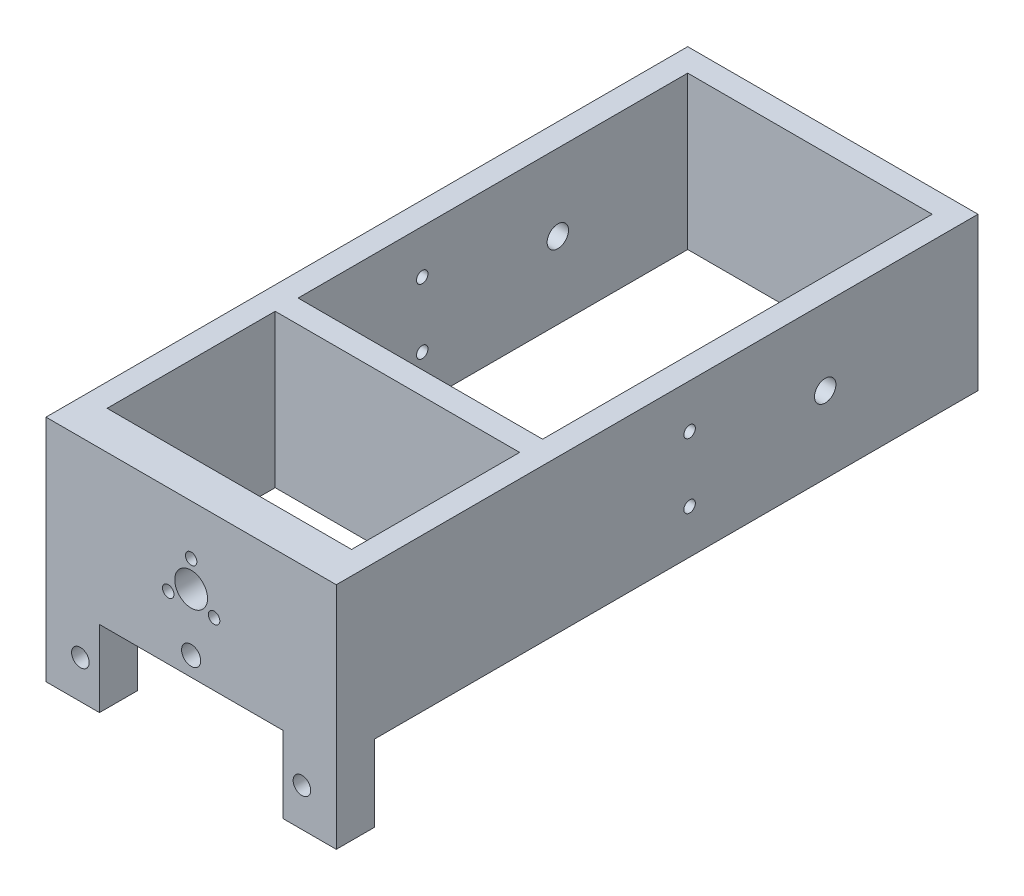
ISO-10303-21;
HEADER;
FILE_DESCRIPTION(('STEP AP214'),'2;1');
FILE_NAME('part.step','',(''),(''),'','','');
FILE_SCHEMA(('AUTOMOTIVE_DESIGN { 1 0 10303 214 1 1 1 1 }'));
ENDSEC;
DATA;
#1=APPLICATION_CONTEXT('core data for automotive mechanical design processes');
#2=APPLICATION_PROTOCOL_DEFINITION('international standard','automotive_design',2000,#1);
#3=PRODUCT_CONTEXT('',#1,'mechanical');
#4=PRODUCT('Part','Part','',(#3));
#5=PRODUCT_RELATED_PRODUCT_CATEGORY('part','',(#4));
#6=PRODUCT_DEFINITION_FORMATION('','',#4);
#7=PRODUCT_DEFINITION_CONTEXT('part definition',#1,'design');
#8=PRODUCT_DEFINITION('design','',#6,#7);
#9=PRODUCT_DEFINITION_SHAPE('','',#8);
#10=(LENGTH_UNIT() NAMED_UNIT(*) SI_UNIT(.MILLI.,.METRE.));
#11=(NAMED_UNIT(*) PLANE_ANGLE_UNIT() SI_UNIT($,.RADIAN.));
#12=(NAMED_UNIT(*) SI_UNIT($,.STERADIAN.) SOLID_ANGLE_UNIT());
#13=UNCERTAINTY_MEASURE_WITH_UNIT(LENGTH_MEASURE(1.E-05),#10,'distance_accuracy_value','');
#14=(GEOMETRIC_REPRESENTATION_CONTEXT(3) GLOBAL_UNCERTAINTY_ASSIGNED_CONTEXT((#13)) GLOBAL_UNIT_ASSIGNED_CONTEXT((#10,
#11,#12)) REPRESENTATION_CONTEXT('',''));
#15=CARTESIAN_POINT('',(0.,0.,0.));
#16=DIRECTION('',(0.,0.,1.));
#17=DIRECTION('',(1.,0.,0.));
#18=AXIS2_PLACEMENT_3D('',#15,#16,#17);
#19=CARTESIAN_POINT('',(19.,-10.,44.));
#20=DIRECTION('',(0.,1.,0.));
#21=DIRECTION('',(0.,0.,1.));
#22=AXIS2_PLACEMENT_3D('',#19,#20,#21);
#23=PLANE('',#22);
#24=DIRECTION('',(0.,0.,-1.));
#25=VECTOR('',#24,1.);
#26=CARTESIAN_POINT('',(12.,-10.,44.));
#27=LINE('',#26,#25);
#28=CARTESIAN_POINT('',(12.,-10.,44.));
#29=VERTEX_POINT('',#28);
#30=CARTESIAN_POINT('',(12.,-10.,39.));
#31=VERTEX_POINT('',#30);
#32=EDGE_CURVE('E76',#29,#31,#27,.T.);
#33=ORIENTED_EDGE('',*,*,#32,.F.);
#34=DIRECTION('',(-1.,0.,0.));
#35=VECTOR('',#34,1.);
#36=CARTESIAN_POINT('',(19.,-10.,44.));
#37=LINE('',#36,#35);
#38=CARTESIAN_POINT('',(-12.,-10.,44.));
#39=VERTEX_POINT('',#38);
#40=EDGE_CURVE('E11',#29,#39,#37,.T.);
#41=ORIENTED_EDGE('',*,*,#40,.T.);
#42=DIRECTION('',(0.,0.,1.));
#43=VECTOR('',#42,1.);
#44=CARTESIAN_POINT('',(-12.,-10.,44.));
#45=LINE('',#44,#43);
#46=CARTESIAN_POINT('',(-12.,-10.,39.));
#47=VERTEX_POINT('',#46);
#48=EDGE_CURVE('E240',#47,#39,#45,.T.);
#49=ORIENTED_EDGE('',*,*,#48,.F.);
#50=DIRECTION('',(1.,0.,0.));
#51=VECTOR('',#50,1.);
#52=CARTESIAN_POINT('',(16.,-10.,39.));
#53=LINE('',#52,#51);
#54=EDGE_CURVE('E328',#47,#31,#53,.T.);
#55=ORIENTED_EDGE('',*,*,#54,.T.);
#56=EDGE_LOOP('',(#33,#41,#49,#55));
#57=FACE_BOUND('',#56,.T.);
#58=ADVANCED_FACE('F51',(#57),#23,.F.);
#59=DIRECTION('',(-1.,0.,0.));
#60=VECTOR('',#59,1.);
#61=CARTESIAN_POINT('',(-16.,-10.,-37.));
#62=LINE('',#61,#60);
#63=CARTESIAN_POINT('',(16.,-10.,-37.));
#64=VERTEX_POINT('',#63);
#65=CARTESIAN_POINT('',(-16.,-10.,-37.));
#66=VERTEX_POINT('',#65);
#67=EDGE_CURVE('E282',#64,#66,#62,.T.);
#68=ORIENTED_EDGE('',*,*,#67,.T.);
#69=DIRECTION('',(0.,0.,1.));
#70=VECTOR('',#69,1.);
#71=CARTESIAN_POINT('',(-16.,-10.,-37.));
#72=LINE('',#71,#70);
#73=CARTESIAN_POINT('',(-16.,-10.,14.));
#74=VERTEX_POINT('',#73);
#75=EDGE_CURVE('E269',#66,#74,#72,.T.);
#76=ORIENTED_EDGE('',*,*,#75,.T.);
#77=DIRECTION('',(1.,0.,0.));
#78=VECTOR('',#77,1.);
#79=CARTESIAN_POINT('',(-16.,-10.,14.));
#80=LINE('',#79,#78);
#81=CARTESIAN_POINT('',(16.,-10.,14.));
#82=VERTEX_POINT('',#81);
#83=EDGE_CURVE('E273',#74,#82,#80,.T.);
#84=ORIENTED_EDGE('',*,*,#83,.T.);
#85=DIRECTION('',(0.,0.,-1.));
#86=VECTOR('',#85,1.);
#87=CARTESIAN_POINT('',(16.,-10.,-37.));
#88=LINE('',#87,#86);
#89=EDGE_CURVE('E278',#82,#64,#88,.T.);
#90=ORIENTED_EDGE('',*,*,#89,.T.);
#91=EDGE_LOOP('',(#68,#76,#84,#90));
#92=FACE_BOUND('',#91,.T.);
#93=DIRECTION('',(1.,0.,0.));
#94=VECTOR('',#93,1.);
#95=CARTESIAN_POINT('',(19.,-10.,39.));
#96=LINE('',#95,#94);
#97=CARTESIAN_POINT('',(16.,-10.,39.));
#98=VERTEX_POINT('',#97);
#99=CARTESIAN_POINT('',(19.,-10.,39.));
#100=VERTEX_POINT('',#99);
#101=EDGE_CURVE('E208',#98,#100,#96,.T.);
#102=ORIENTED_EDGE('',*,*,#101,.F.);
#103=DIRECTION('',(0.,0.,-1.));
#104=VECTOR('',#103,1.);
#105=CARTESIAN_POINT('',(16.,-10.,17.));
#106=LINE('',#105,#104);
#107=CARTESIAN_POINT('',(16.,-10.,17.));
#108=VERTEX_POINT('',#107);
#109=EDGE_CURVE('E315',#98,#108,#106,.T.);
#110=ORIENTED_EDGE('',*,*,#109,.T.);
#111=DIRECTION('',(-1.,0.,0.));
#112=VECTOR('',#111,1.);
#113=CARTESIAN_POINT('',(16.,-10.,17.));
#114=LINE('',#113,#112);
#115=CARTESIAN_POINT('',(-16.,-10.,17.));
#116=VERTEX_POINT('',#115);
#117=EDGE_CURVE('E319',#108,#116,#114,.T.);
#118=ORIENTED_EDGE('',*,*,#117,.T.);
#119=DIRECTION('',(0.,0.,1.));
#120=VECTOR('',#119,1.);
#121=CARTESIAN_POINT('',(-16.,-10.,17.));
#122=LINE('',#121,#120);
#123=CARTESIAN_POINT('',(-16.,-10.,39.));
#124=VERTEX_POINT('',#123);
#125=EDGE_CURVE('E324',#116,#124,#122,.T.);
#126=ORIENTED_EDGE('',*,*,#125,.T.);
#127=DIRECTION('',(1.,0.,0.));
#128=VECTOR('',#127,1.);
#129=CARTESIAN_POINT('',(-19.,-10.,39.));
#130=LINE('',#129,#128);
#131=CARTESIAN_POINT('',(-19.,-10.,39.));
#132=VERTEX_POINT('',#131);
#133=EDGE_CURVE('E234',#132,#124,#130,.T.);
#134=ORIENTED_EDGE('',*,*,#133,.F.);
#135=DIRECTION('',(0.,0.,-1.));
#136=VECTOR('',#135,1.);
#137=CARTESIAN_POINT('',(-19.,-10.,44.));
#138=LINE('',#137,#136);
#139=CARTESIAN_POINT('',(-19.,-10.,-40.));
#140=VERTEX_POINT('',#139);
#141=EDGE_CURVE('E407',#132,#140,#138,.T.);
#142=ORIENTED_EDGE('',*,*,#141,.T.);
#143=DIRECTION('',(-1.,0.,0.));
#144=VECTOR('',#143,1.);
#145=CARTESIAN_POINT('',(19.,-10.,-40.));
#146=LINE('',#145,#144);
#147=CARTESIAN_POINT('',(19.,-10.,-40.));
#148=VERTEX_POINT('',#147);
#149=EDGE_CURVE('E61',#148,#140,#146,.T.);
#150=ORIENTED_EDGE('',*,*,#149,.F.);
#151=DIRECTION('',(0.,0.,-1.));
#152=VECTOR('',#151,1.);
#153=CARTESIAN_POINT('',(19.,-10.,44.));
#154=LINE('',#153,#152);
#155=EDGE_CURVE('E69',#100,#148,#154,.T.);
#156=ORIENTED_EDGE('',*,*,#155,.F.);
#157=EDGE_LOOP('',(#102,#110,#118,#126,#134,#142,#150,#156));
#158=FACE_BOUND('',#157,.T.);
#159=ADVANCED_FACE('F456',(#92,#158),#23,.F.);
#160=CARTESIAN_POINT('',(19.,4.25,-2.25000000000001));
#161=DIRECTION('',(-1.,0.,0.));
#162=DIRECTION('',(0.,0.,1.));
#163=AXIS2_PLACEMENT_3D('',#160,#161,#162);
#164=CYLINDRICAL_SURFACE('',#163,0.75);
#165=CARTESIAN_POINT('',(-16.,4.25,-2.25000000000001));
#166=DIRECTION('',(-1.,0.,0.));
#167=DIRECTION('',(0.,0.,1.));
#168=AXIS2_PLACEMENT_3D('',#165,#166,#167);
#169=CIRCLE('',#168,0.75);
#170=CARTESIAN_POINT('',(-16.,4.25,-1.50000000000001));
#171=VERTEX_POINT('',#170);
#172=EDGE_CURVE('E368',#171,#171,#169,.T.);
#173=ORIENTED_EDGE('',*,*,#172,.F.);
#174=EDGE_LOOP('',(#173));
#175=FACE_BOUND('',#174,.T.);
#176=CARTESIAN_POINT('',(-19.,4.25,-2.25000000000001));
#177=DIRECTION('',(1.,0.,0.));
#178=DIRECTION('',(0.,0.,-1.));
#179=AXIS2_PLACEMENT_3D('',#176,#177,#178);
#180=CIRCLE('',#179,0.75);
#181=CARTESIAN_POINT('',(-19.,4.25,-3.00000000000001));
#182=VERTEX_POINT('',#181);
#183=EDGE_CURVE('E385',#182,#182,#180,.T.);
#184=ORIENTED_EDGE('',*,*,#183,.F.);
#185=EDGE_LOOP('',(#184));
#186=FACE_BOUND('',#185,.T.);
#187=ADVANCED_FACE('F460',(#175,#186),#164,.F.);
#188=CARTESIAN_POINT('',(19.,-4.25,-2.25000000000001));
#189=DIRECTION('',(-1.,0.,0.));
#190=DIRECTION('',(0.,0.,1.));
#191=AXIS2_PLACEMENT_3D('',#188,#189,#190);
#192=CYLINDRICAL_SURFACE('',#191,0.750000000000002);
#193=CARTESIAN_POINT('',(-16.,-4.25,-2.25000000000001));
#194=DIRECTION('',(-1.,0.,0.));
#195=DIRECTION('',(0.,0.,1.));
#196=AXIS2_PLACEMENT_3D('',#193,#194,#195);
#197=CIRCLE('',#196,0.750000000000002);
#198=CARTESIAN_POINT('',(-16.,-4.25,-1.50000000000001));
#199=VERTEX_POINT('',#198);
#200=EDGE_CURVE('E364',#199,#199,#197,.T.);
#201=ORIENTED_EDGE('',*,*,#200,.F.);
#202=EDGE_LOOP('',(#201));
#203=FACE_BOUND('',#202,.T.);
#204=CARTESIAN_POINT('',(-19.,-4.25,-2.25000000000001));
#205=DIRECTION('',(1.,0.,0.));
#206=DIRECTION('',(0.,0.,1.));
#207=AXIS2_PLACEMENT_3D('',#204,#205,#206);
#208=CIRCLE('',#207,0.750000000000002);
#209=CARTESIAN_POINT('',(-19.,-4.25,-1.50000000000001));
#210=VERTEX_POINT('',#209);
#211=EDGE_CURVE('E377',#210,#210,#208,.T.);
#212=ORIENTED_EDGE('',*,*,#211,.F.);
#213=EDGE_LOOP('',(#212));
#214=FACE_BOUND('',#213,.T.);
#215=ADVANCED_FACE('F451',(#203,#214),#192,.F.);
#216=CARTESIAN_POINT('',(19.,0.,-20.));
#217=DIRECTION('',(-1.,0.,0.));
#218=DIRECTION('',(0.,0.,1.));
#219=AXIS2_PLACEMENT_3D('',#216,#217,#218);
#220=CYLINDRICAL_SURFACE('',#219,1.4);
#221=CARTESIAN_POINT('',(-16.,0.,-20.));
#222=DIRECTION('',(-1.,0.,0.));
#223=DIRECTION('',(0.,0.,1.));
#224=AXIS2_PLACEMENT_3D('',#221,#222,#223);
#225=CIRCLE('',#224,1.4);
#226=CARTESIAN_POINT('',(-16.,0.,-18.6));
#227=VERTEX_POINT('',#226);
#228=EDGE_CURVE('E55',#227,#227,#225,.T.);
#229=ORIENTED_EDGE('',*,*,#228,.F.);
#230=EDGE_LOOP('',(#229));
#231=FACE_BOUND('',#230,.T.);
#232=CARTESIAN_POINT('',(-19.,0.,-20.));
#233=DIRECTION('',(1.,0.,0.));
#234=DIRECTION('',(0.,0.,-1.));
#235=AXIS2_PLACEMENT_3D('',#232,#233,#234);
#236=CIRCLE('',#235,1.4);
#237=CARTESIAN_POINT('',(-19.,0.,-21.4));
#238=VERTEX_POINT('',#237);
#239=EDGE_CURVE('E372',#238,#238,#236,.T.);
#240=ORIENTED_EDGE('',*,*,#239,.F.);
#241=EDGE_LOOP('',(#240));
#242=FACE_BOUND('',#241,.T.);
#243=ADVANCED_FACE('F438',(#231,#242),#220,.F.);
#244=CARTESIAN_POINT('',(19.,0.,0.));
#245=DIRECTION('',(1.,0.,0.));
#246=DIRECTION('',(0.,0.,-1.));
#247=AXIS2_PLACEMENT_3D('',#244,#245,#246);
#248=PLANE('',#247);
#249=CARTESIAN_POINT('',(19.,-4.25,-2.25000000000001));
#250=DIRECTION('',(1.,0.,0.));
#251=DIRECTION('',(0.,0.,1.));
#252=AXIS2_PLACEMENT_3D('',#249,#250,#251);
#253=CIRCLE('',#252,0.750000000000002);
#254=CARTESIAN_POINT('',(19.,-4.25,-1.50000000000001));
#255=VERTEX_POINT('',#254);
#256=EDGE_CURVE('E381',#255,#255,#253,.T.);
#257=ORIENTED_EDGE('',*,*,#256,.F.);
#258=EDGE_LOOP('',(#257));
#259=FACE_BOUND('',#258,.T.);
#260=DIRECTION('',(0.,-1.,0.));
#261=VECTOR('',#260,1.);
#262=CARTESIAN_POINT('',(19.,10.,44.));
#263=LINE('',#262,#261);
#264=CARTESIAN_POINT('',(19.,10.,44.));
#265=VERTEX_POINT('',#264);
#266=CARTESIAN_POINT('',(19.,-20.,44.));
#267=VERTEX_POINT('',#266);
#268=EDGE_CURVE('E179',#265,#267,#263,.T.);
#269=ORIENTED_EDGE('',*,*,#268,.T.);
#270=DIRECTION('',(0.,0.,1.));
#271=VECTOR('',#270,1.);
#272=CARTESIAN_POINT('',(19.,-20.,44.));
#273=LINE('',#272,#271);
#274=CARTESIAN_POINT('',(19.,-20.,39.));
#275=VERTEX_POINT('',#274);
#276=EDGE_CURVE('E185',#275,#267,#273,.T.);
#277=ORIENTED_EDGE('',*,*,#276,.F.);
#278=DIRECTION('',(0.,1.,0.));
#279=VECTOR('',#278,1.);
#280=CARTESIAN_POINT('',(19.,-20.,39.));
#281=LINE('',#280,#279);
#282=EDGE_CURVE('E222',#275,#100,#281,.T.);
#283=ORIENTED_EDGE('',*,*,#282,.T.);
#284=ORIENTED_EDGE('',*,*,#155,.T.);
#285=DIRECTION('',(0.,1.,0.));
#286=VECTOR('',#285,1.);
#287=CARTESIAN_POINT('',(19.,10.,-40.));
#288=LINE('',#287,#286);
#289=CARTESIAN_POINT('',(19.,10.,-40.));
#290=VERTEX_POINT('',#289);
#291=EDGE_CURVE('E399',#148,#290,#288,.T.);
#292=ORIENTED_EDGE('',*,*,#291,.T.);
#293=DIRECTION('',(0.,0.,1.));
#294=VECTOR('',#293,1.);
#295=CARTESIAN_POINT('',(19.,10.,44.));
#296=LINE('',#295,#294);
#297=EDGE_CURVE('E187',#290,#265,#296,.T.);
#298=ORIENTED_EDGE('',*,*,#297,.T.);
#299=EDGE_LOOP('',(#269,#277,#283,#284,#292,#298));
#300=FACE_BOUND('',#299,.T.);
#301=CARTESIAN_POINT('',(19.,4.25,-2.25000000000001));
#302=DIRECTION('',(1.,0.,0.));
#303=DIRECTION('',(0.,0.,-1.));
#304=AXIS2_PLACEMENT_3D('',#301,#302,#303);
#305=CIRCLE('',#304,0.75);
#306=CARTESIAN_POINT('',(19.,4.25,-3.00000000000001));
#307=VERTEX_POINT('',#306);
#308=EDGE_CURVE('E389',#307,#307,#305,.T.);
#309=ORIENTED_EDGE('',*,*,#308,.F.);
#310=EDGE_LOOP('',(#309));
#311=FACE_BOUND('',#310,.T.);
#312=CARTESIAN_POINT('',(19.,0.,-20.));
#313=DIRECTION('',(1.,0.,0.));
#314=DIRECTION('',(0.,0.,-1.));
#315=AXIS2_PLACEMENT_3D('',#312,#313,#314);
#316=CIRCLE('',#315,1.4);
#317=CARTESIAN_POINT('',(19.,0.,-21.4));
#318=VERTEX_POINT('',#317);
#319=EDGE_CURVE('E373',#318,#318,#316,.T.);
#320=ORIENTED_EDGE('',*,*,#319,.F.);
#321=EDGE_LOOP('',(#320));
#322=FACE_BOUND('',#321,.T.);
#323=ADVANCED_FACE('F181',(#259,#300,#311,#322),#248,.T.);
#324=CARTESIAN_POINT('',(-19.,0.,0.));
#325=DIRECTION('',(1.,0.,0.));
#326=DIRECTION('',(0.,0.,-1.));
#327=AXIS2_PLACEMENT_3D('',#324,#325,#326);
#328=PLANE('',#327);
#329=DIRECTION('',(0.,-1.,0.));
#330=VECTOR('',#329,1.);
#331=CARTESIAN_POINT('',(-19.,10.,44.));
#332=LINE('',#331,#330);
#333=CARTESIAN_POINT('',(-19.,10.,44.));
#334=VERTEX_POINT('',#333);
#335=CARTESIAN_POINT('',(-19.,-20.,44.));
#336=VERTEX_POINT('',#335);
#337=EDGE_CURVE('E393',#334,#336,#332,.T.);
#338=ORIENTED_EDGE('',*,*,#337,.F.);
#339=DIRECTION('',(0.,0.,1.));
#340=VECTOR('',#339,1.);
#341=CARTESIAN_POINT('',(-19.,10.,44.));
#342=LINE('',#341,#340);
#343=CARTESIAN_POINT('',(-19.,10.,-40.));
#344=VERTEX_POINT('',#343);
#345=EDGE_CURVE('E192',#344,#334,#342,.T.);
#346=ORIENTED_EDGE('',*,*,#345,.F.);
#347=DIRECTION('',(0.,1.,0.));
#348=VECTOR('',#347,1.);
#349=CARTESIAN_POINT('',(-19.,10.,-40.));
#350=LINE('',#349,#348);
#351=EDGE_CURVE('E410',#140,#344,#350,.T.);
#352=ORIENTED_EDGE('',*,*,#351,.F.);
#353=ORIENTED_EDGE('',*,*,#141,.F.);
#354=DIRECTION('',(0.,1.,0.));
#355=VECTOR('',#354,1.);
#356=CARTESIAN_POINT('',(-19.,-20.,39.));
#357=LINE('',#356,#355);
#358=CARTESIAN_POINT('',(-19.,-20.,39.));
#359=VERTEX_POINT('',#358);
#360=EDGE_CURVE('E264',#359,#132,#357,.T.);
#361=ORIENTED_EDGE('',*,*,#360,.F.);
#362=DIRECTION('',(0.,0.,-1.));
#363=VECTOR('',#362,1.);
#364=CARTESIAN_POINT('',(-19.,-20.,44.));
#365=LINE('',#364,#363);
#366=EDGE_CURVE('E235',#336,#359,#365,.T.);
#367=ORIENTED_EDGE('',*,*,#366,.F.);
#368=EDGE_LOOP('',(#338,#346,#352,#353,#361,#367));
#369=FACE_BOUND('',#368,.T.);
#370=ORIENTED_EDGE('',*,*,#183,.T.);
#371=EDGE_LOOP('',(#370));
#372=FACE_BOUND('',#371,.T.);
#373=ORIENTED_EDGE('',*,*,#211,.T.);
#374=EDGE_LOOP('',(#373));
#375=FACE_BOUND('',#374,.T.);
#376=ORIENTED_EDGE('',*,*,#239,.T.);
#377=EDGE_LOOP('',(#376));
#378=FACE_BOUND('',#377,.T.);
#379=ADVANCED_FACE('F442',(#369,#372,#375,#378),#328,.F.);
#380=CARTESIAN_POINT('',(19.,10.,44.));
#381=DIRECTION('',(0.,0.,-1.));
#382=DIRECTION('',(-1.,0.,0.));
#383=AXIS2_PLACEMENT_3D('',#380,#381,#382);
#384=PLANE('',#383);
#385=CARTESIAN_POINT('',(0.,3.46410161513776,44.));
#386=DIRECTION('',(0.,0.,1.));
#387=DIRECTION('',(1.,0.,0.));
#388=AXIS2_PLACEMENT_3D('',#385,#386,#387);
#389=CIRCLE('',#388,0.75);
#390=CARTESIAN_POINT('',(0.75,3.46410161513776,44.));
#391=VERTEX_POINT('',#390);
#392=EDGE_CURVE('E224',#391,#391,#389,.T.);
#393=ORIENTED_EDGE('',*,*,#392,.F.);
#394=EDGE_LOOP('',(#393));
#395=FACE_BOUND('',#394,.T.);
#396=CARTESIAN_POINT('',(0.,-7.5,44.));
#397=DIRECTION('',(0.,0.,1.));
#398=DIRECTION('',(1.,0.,0.));
#399=AXIS2_PLACEMENT_3D('',#396,#397,#398);
#400=CIRCLE('',#399,1.25);
#401=CARTESIAN_POINT('',(1.25,-7.5,44.));
#402=VERTEX_POINT('',#401);
#403=EDGE_CURVE('E642',#402,#402,#400,.T.);
#404=ORIENTED_EDGE('',*,*,#403,.F.);
#405=EDGE_LOOP('',(#404));
#406=FACE_BOUND('',#405,.T.);
#407=CARTESIAN_POINT('',(0.,0.,44.));
#408=DIRECTION('',(0.,0.,1.));
#409=DIRECTION('',(1.,0.,0.));
#410=AXIS2_PLACEMENT_3D('',#407,#408,#409);
#411=CIRCLE('',#410,2.15);
#412=CARTESIAN_POINT('',(2.15,0.,44.));
#413=VERTEX_POINT('',#412);
#414=EDGE_CURVE('E641',#413,#413,#411,.T.);
#415=ORIENTED_EDGE('',*,*,#414,.F.);
#416=EDGE_LOOP('',(#415));
#417=FACE_BOUND('',#416,.T.);
#418=CARTESIAN_POINT('',(-3.,-1.73205080756888,44.));
#419=DIRECTION('',(0.,0.,1.));
#420=DIRECTION('',(1.,0.,0.));
#421=AXIS2_PLACEMENT_3D('',#418,#419,#420);
#422=CIRCLE('',#421,0.75);
#423=CARTESIAN_POINT('',(-2.25,-1.73205080756888,44.));
#424=VERTEX_POINT('',#423);
#425=EDGE_CURVE('E657',#424,#424,#422,.T.);
#426=ORIENTED_EDGE('',*,*,#425,.F.);
#427=EDGE_LOOP('',(#426));
#428=FACE_BOUND('',#427,.T.);
#429=CARTESIAN_POINT('',(3.,-1.73205080756888,44.));
#430=DIRECTION('',(0.,0.,1.));
#431=DIRECTION('',(1.,0.,0.));
#432=AXIS2_PLACEMENT_3D('',#429,#430,#431);
#433=CIRCLE('',#432,0.75);
#434=CARTESIAN_POINT('',(3.75,-1.73205080756888,44.));
#435=VERTEX_POINT('',#434);
#436=EDGE_CURVE('E626',#435,#435,#433,.T.);
#437=ORIENTED_EDGE('',*,*,#436,.F.);
#438=EDGE_LOOP('',(#437));
#439=FACE_BOUND('',#438,.T.);
#440=CARTESIAN_POINT('',(-14.5,-15.,44.));
#441=DIRECTION('',(0.,0.,1.));
#442=DIRECTION('',(1.,0.,0.));
#443=AXIS2_PLACEMENT_3D('',#440,#441,#442);
#444=CIRCLE('',#443,1.15);
#445=CARTESIAN_POINT('',(-13.35,-15.,44.));
#446=VERTEX_POINT('',#445);
#447=EDGE_CURVE('E665',#446,#446,#444,.T.);
#448=ORIENTED_EDGE('',*,*,#447,.F.);
#449=EDGE_LOOP('',(#448));
#450=FACE_BOUND('',#449,.T.);
#451=CARTESIAN_POINT('',(14.5,-15.,44.));
#452=DIRECTION('',(0.,0.,1.));
#453=DIRECTION('',(-1.,0.,0.));
#454=AXIS2_PLACEMENT_3D('',#451,#452,#453);
#455=CIRCLE('',#454,1.15);
#456=CARTESIAN_POINT('',(13.35,-15.,44.));
#457=VERTEX_POINT('',#456);
#458=EDGE_CURVE('E671',#457,#457,#455,.T.);
#459=ORIENTED_EDGE('',*,*,#458,.F.);
#460=EDGE_LOOP('',(#459));
#461=FACE_BOUND('',#460,.T.);
#462=ORIENTED_EDGE('',*,*,#337,.T.);
#463=DIRECTION('',(-1.,0.,0.));
#464=VECTOR('',#463,1.);
#465=CARTESIAN_POINT('',(-19.,-20.,44.));
#466=LINE('',#465,#464);
#467=CARTESIAN_POINT('',(-12.,-20.,44.));
#468=VERTEX_POINT('',#467);
#469=EDGE_CURVE('E246',#468,#336,#466,.T.);
#470=ORIENTED_EDGE('',*,*,#469,.F.);
#471=DIRECTION('',(0.,1.,0.));
#472=VECTOR('',#471,1.);
#473=CARTESIAN_POINT('',(-12.,-20.,44.));
#474=LINE('',#473,#472);
#475=EDGE_CURVE('E250',#468,#39,#474,.T.);
#476=ORIENTED_EDGE('',*,*,#475,.T.);
#477=ORIENTED_EDGE('',*,*,#40,.F.);
#478=DIRECTION('',(0.,1.,0.));
#479=VECTOR('',#478,1.);
#480=CARTESIAN_POINT('',(12.,-20.,44.));
#481=LINE('',#480,#479);
#482=CARTESIAN_POINT('',(12.,-20.,44.));
#483=VERTEX_POINT('',#482);
#484=EDGE_CURVE('E197',#483,#29,#481,.T.);
#485=ORIENTED_EDGE('',*,*,#484,.F.);
#486=DIRECTION('',(-1.,0.,0.));
#487=VECTOR('',#486,1.);
#488=CARTESIAN_POINT('',(19.,-20.,44.));
#489=LINE('',#488,#487);
#490=EDGE_CURVE('E195',#267,#483,#489,.T.);
#491=ORIENTED_EDGE('',*,*,#490,.F.);
#492=ORIENTED_EDGE('',*,*,#268,.F.);
#493=DIRECTION('',(-1.,0.,0.));
#494=VECTOR('',#493,1.);
#495=CARTESIAN_POINT('',(19.,10.,44.));
#496=LINE('',#495,#494);
#497=EDGE_CURVE('E404',#265,#334,#496,.T.);
#498=ORIENTED_EDGE('',*,*,#497,.T.);
#499=EDGE_LOOP('',(#462,#470,#476,#477,#485,#491,#492,#498));
#500=FACE_BOUND('',#499,.T.);
#501=ADVANCED_FACE('F53',(#395,#406,#417,#428,#439,#450,#461,#500),#384,.F.);
#502=CARTESIAN_POINT('',(19.,10.,-40.));
#503=DIRECTION('',(0.,0.,1.));
#504=DIRECTION('',(1.,0.,0.));
#505=AXIS2_PLACEMENT_3D('',#502,#503,#504);
#506=PLANE('',#505);
#507=ORIENTED_EDGE('',*,*,#351,.T.);
#508=DIRECTION('',(-1.,0.,0.));
#509=VECTOR('',#508,1.);
#510=CARTESIAN_POINT('',(19.,10.,-40.));
#511=LINE('',#510,#509);
#512=EDGE_CURVE('E417',#290,#344,#511,.T.);
#513=ORIENTED_EDGE('',*,*,#512,.F.);
#514=ORIENTED_EDGE('',*,*,#291,.F.);
#515=ORIENTED_EDGE('',*,*,#149,.T.);
#516=EDGE_LOOP('',(#507,#513,#514,#515));
#517=FACE_BOUND('',#516,.T.);
#518=ADVANCED_FACE('F463',(#517),#506,.F.);
#519=CARTESIAN_POINT('',(19.,10.,44.));
#520=DIRECTION('',(0.,-1.,0.));
#521=DIRECTION('',(0.,0.,-1.));
#522=AXIS2_PLACEMENT_3D('',#519,#520,#521);
#523=PLANE('',#522);
#524=DIRECTION('',(1.,0.,0.));
#525=VECTOR('',#524,1.);
#526=CARTESIAN_POINT('',(-16.,10.,14.));
#527=LINE('',#526,#525);
#528=CARTESIAN_POINT('',(-16.,10.,14.));
#529=VERTEX_POINT('',#528);
#530=CARTESIAN_POINT('',(16.,10.,14.));
#531=VERTEX_POINT('',#530);
#532=EDGE_CURVE('E290',#529,#531,#527,.T.);
#533=ORIENTED_EDGE('',*,*,#532,.F.);
#534=DIRECTION('',(0.,0.,1.));
#535=VECTOR('',#534,1.);
#536=CARTESIAN_POINT('',(-16.,10.,-37.));
#537=LINE('',#536,#535);
#538=CARTESIAN_POINT('',(-16.,10.,-37.));
#539=VERTEX_POINT('',#538);
#540=EDGE_CURVE('E287',#539,#529,#537,.T.);
#541=ORIENTED_EDGE('',*,*,#540,.F.);
#542=DIRECTION('',(-1.,0.,0.));
#543=VECTOR('',#542,1.);
#544=CARTESIAN_POINT('',(-16.,10.,-37.));
#545=LINE('',#544,#543);
#546=CARTESIAN_POINT('',(16.,10.,-37.));
#547=VERTEX_POINT('',#546);
#548=EDGE_CURVE('E274',#547,#539,#545,.T.);
#549=ORIENTED_EDGE('',*,*,#548,.F.);
#550=DIRECTION('',(0.,0.,-1.));
#551=VECTOR('',#550,1.);
#552=CARTESIAN_POINT('',(16.,10.,-37.));
#553=LINE('',#552,#551);
#554=EDGE_CURVE('E295',#531,#547,#553,.T.);
#555=ORIENTED_EDGE('',*,*,#554,.F.);
#556=EDGE_LOOP('',(#533,#541,#549,#555));
#557=FACE_BOUND('',#556,.T.);
#558=DIRECTION('',(-1.,0.,0.));
#559=VECTOR('',#558,1.);
#560=CARTESIAN_POINT('',(16.,10.,17.));
#561=LINE('',#560,#559);
#562=CARTESIAN_POINT('',(16.,10.,17.));
#563=VERTEX_POINT('',#562);
#564=CARTESIAN_POINT('',(-16.,10.,17.));
#565=VERTEX_POINT('',#564);
#566=EDGE_CURVE('E334',#563,#565,#561,.T.);
#567=ORIENTED_EDGE('',*,*,#566,.F.);
#568=DIRECTION('',(0.,0.,-1.));
#569=VECTOR('',#568,1.);
#570=CARTESIAN_POINT('',(16.,10.,17.));
#571=LINE('',#570,#569);
#572=CARTESIAN_POINT('',(16.,10.,39.));
#573=VERTEX_POINT('',#572);
#574=EDGE_CURVE('E268',#573,#563,#571,.T.);
#575=ORIENTED_EDGE('',*,*,#574,.F.);
#576=DIRECTION('',(1.,0.,0.));
#577=VECTOR('',#576,1.);
#578=CARTESIAN_POINT('',(16.,10.,39.));
#579=LINE('',#578,#577);
#580=CARTESIAN_POINT('',(-16.,10.,39.));
#581=VERTEX_POINT('',#580);
#582=EDGE_CURVE('E320',#581,#573,#579,.T.);
#583=ORIENTED_EDGE('',*,*,#582,.F.);
#584=DIRECTION('',(0.,0.,1.));
#585=VECTOR('',#584,1.);
#586=CARTESIAN_POINT('',(-16.,10.,17.));
#587=LINE('',#586,#585);
#588=EDGE_CURVE('E338',#565,#581,#587,.T.);
#589=ORIENTED_EDGE('',*,*,#588,.F.);
#590=EDGE_LOOP('',(#567,#575,#583,#589));
#591=FACE_BOUND('',#590,.T.);
#592=ORIENTED_EDGE('',*,*,#345,.T.);
#593=ORIENTED_EDGE('',*,*,#497,.F.);
#594=ORIENTED_EDGE('',*,*,#297,.F.);
#595=ORIENTED_EDGE('',*,*,#512,.T.);
#596=EDGE_LOOP('',(#592,#593,#594,#595));
#597=FACE_BOUND('',#596,.T.);
#598=ADVANCED_FACE('F466',(#557,#591,#597),#523,.F.);
#599=CARTESIAN_POINT('',(16.,4.25,-2.25000000000001));
#600=DIRECTION('',(1.,0.,0.));
#601=DIRECTION('',(0.,0.,-1.));
#602=AXIS2_PLACEMENT_3D('',#599,#600,#601);
#603=CIRCLE('',#602,0.75);
#604=CARTESIAN_POINT('',(16.,4.25,-3.00000000000001));
#605=VERTEX_POINT('',#604);
#606=EDGE_CURVE('E360',#605,#605,#603,.T.);
#607=ORIENTED_EDGE('',*,*,#606,.F.);
#608=EDGE_LOOP('',(#607));
#609=FACE_BOUND('',#608,.T.);
#610=ORIENTED_EDGE('',*,*,#308,.T.);
#611=EDGE_LOOP('',(#610));
#612=FACE_BOUND('',#611,.T.);
#613=ADVANCED_FACE('F469',(#609,#612),#164,.F.);
#614=CARTESIAN_POINT('',(16.,-4.25,-2.25000000000001));
#615=DIRECTION('',(1.,0.,0.));
#616=DIRECTION('',(0.,0.,-1.));
#617=AXIS2_PLACEMENT_3D('',#614,#615,#616);
#618=CIRCLE('',#617,0.750000000000002);
#619=CARTESIAN_POINT('',(16.,-4.25,-3.00000000000001));
#620=VERTEX_POINT('',#619);
#621=EDGE_CURVE('E356',#620,#620,#618,.T.);
#622=ORIENTED_EDGE('',*,*,#621,.F.);
#623=EDGE_LOOP('',(#622));
#624=FACE_BOUND('',#623,.T.);
#625=ORIENTED_EDGE('',*,*,#256,.T.);
#626=EDGE_LOOP('',(#625));
#627=FACE_BOUND('',#626,.T.);
#628=ADVANCED_FACE('F436',(#624,#627),#192,.F.);
#629=CARTESIAN_POINT('',(16.,0.,-20.));
#630=DIRECTION('',(1.,0.,0.));
#631=DIRECTION('',(0.,0.,-1.));
#632=AXIS2_PLACEMENT_3D('',#629,#630,#631);
#633=CIRCLE('',#632,1.4);
#634=CARTESIAN_POINT('',(16.,0.,-21.4));
#635=VERTEX_POINT('',#634);
#636=EDGE_CURVE('E305',#635,#635,#633,.T.);
#637=ORIENTED_EDGE('',*,*,#636,.F.);
#638=EDGE_LOOP('',(#637));
#639=FACE_BOUND('',#638,.T.);
#640=ORIENTED_EDGE('',*,*,#319,.T.);
#641=EDGE_LOOP('',(#640));
#642=FACE_BOUND('',#641,.T.);
#643=ADVANCED_FACE('F432',(#639,#642),#220,.F.);
#644=CARTESIAN_POINT('',(-16.,-10.,-37.));
#645=DIRECTION('',(-1.,0.,0.));
#646=DIRECTION('',(0.,0.,1.));
#647=AXIS2_PLACEMENT_3D('',#644,#645,#646);
#648=PLANE('',#647);
#649=ORIENTED_EDGE('',*,*,#172,.T.);
#650=EDGE_LOOP('',(#649));
#651=FACE_BOUND('',#650,.T.);
#652=ORIENTED_EDGE('',*,*,#200,.T.);
#653=EDGE_LOOP('',(#652));
#654=FACE_BOUND('',#653,.T.);
#655=ORIENTED_EDGE('',*,*,#228,.T.);
#656=EDGE_LOOP('',(#655));
#657=FACE_BOUND('',#656,.T.);
#658=ORIENTED_EDGE('',*,*,#540,.T.);
#659=DIRECTION('',(0.,1.,0.));
#660=VECTOR('',#659,1.);
#661=CARTESIAN_POINT('',(-16.,-10.,14.));
#662=LINE('',#661,#660);
#663=EDGE_CURVE('E286',#74,#529,#662,.T.);
#664=ORIENTED_EDGE('',*,*,#663,.F.);
#665=ORIENTED_EDGE('',*,*,#75,.F.);
#666=DIRECTION('',(0.,1.,0.));
#667=VECTOR('',#666,1.);
#668=CARTESIAN_POINT('',(-16.,-10.,-37.));
#669=LINE('',#668,#667);
#670=EDGE_CURVE('E302',#66,#539,#669,.T.);
#671=ORIENTED_EDGE('',*,*,#670,.T.);
#672=EDGE_LOOP('',(#658,#664,#665,#671));
#673=FACE_BOUND('',#672,.T.);
#674=ADVANCED_FACE('F435',(#651,#654,#657,#673),#648,.F.);
#675=CARTESIAN_POINT('',(-16.,-10.,-37.));
#676=DIRECTION('',(0.,0.,-1.));
#677=DIRECTION('',(-1.,0.,0.));
#678=AXIS2_PLACEMENT_3D('',#675,#676,#677);
#679=PLANE('',#678);
#680=ORIENTED_EDGE('',*,*,#548,.T.);
#681=ORIENTED_EDGE('',*,*,#670,.F.);
#682=ORIENTED_EDGE('',*,*,#67,.F.);
#683=DIRECTION('',(0.,1.,0.));
#684=VECTOR('',#683,1.);
#685=CARTESIAN_POINT('',(16.,-10.,-37.));
#686=LINE('',#685,#684);
#687=EDGE_CURVE('E306',#64,#547,#686,.T.);
#688=ORIENTED_EDGE('',*,*,#687,.T.);
#689=EDGE_LOOP('',(#680,#681,#682,#688));
#690=FACE_BOUND('',#689,.T.);
#691=ADVANCED_FACE('F552',(#690),#679,.F.);
#692=CARTESIAN_POINT('',(16.,-10.,-37.));
#693=DIRECTION('',(1.,0.,0.));
#694=DIRECTION('',(0.,0.,-1.));
#695=AXIS2_PLACEMENT_3D('',#692,#693,#694);
#696=PLANE('',#695);
#697=ORIENTED_EDGE('',*,*,#606,.T.);
#698=EDGE_LOOP('',(#697));
#699=FACE_BOUND('',#698,.T.);
#700=ORIENTED_EDGE('',*,*,#621,.T.);
#701=EDGE_LOOP('',(#700));
#702=FACE_BOUND('',#701,.T.);
#703=ORIENTED_EDGE('',*,*,#636,.T.);
#704=EDGE_LOOP('',(#703));
#705=FACE_BOUND('',#704,.T.);
#706=ORIENTED_EDGE('',*,*,#554,.T.);
#707=ORIENTED_EDGE('',*,*,#687,.F.);
#708=ORIENTED_EDGE('',*,*,#89,.F.);
#709=DIRECTION('',(0.,1.,0.));
#710=VECTOR('',#709,1.);
#711=CARTESIAN_POINT('',(16.,-10.,14.));
#712=LINE('',#711,#710);
#713=EDGE_CURVE('E309',#82,#531,#712,.T.);
#714=ORIENTED_EDGE('',*,*,#713,.T.);
#715=EDGE_LOOP('',(#706,#707,#708,#714));
#716=FACE_BOUND('',#715,.T.);
#717=ADVANCED_FACE('F429',(#699,#702,#705,#716),#696,.F.);
#718=CARTESIAN_POINT('',(-16.,-10.,14.));
#719=DIRECTION('',(0.,0.,1.));
#720=DIRECTION('',(1.,0.,0.));
#721=AXIS2_PLACEMENT_3D('',#718,#719,#720);
#722=PLANE('',#721);
#723=ORIENTED_EDGE('',*,*,#532,.T.);
#724=ORIENTED_EDGE('',*,*,#713,.F.);
#725=ORIENTED_EDGE('',*,*,#83,.F.);
#726=ORIENTED_EDGE('',*,*,#663,.T.);
#727=EDGE_LOOP('',(#723,#724,#725,#726));
#728=FACE_BOUND('',#727,.T.);
#729=ADVANCED_FACE('F517',(#728),#722,.F.);
#730=CARTESIAN_POINT('',(16.,-10.,17.));
#731=DIRECTION('',(1.,0.,0.));
#732=DIRECTION('',(0.,0.,-1.));
#733=AXIS2_PLACEMENT_3D('',#730,#731,#732);
#734=PLANE('',#733);
#735=ORIENTED_EDGE('',*,*,#574,.T.);
#736=DIRECTION('',(0.,1.,0.));
#737=VECTOR('',#736,1.);
#738=CARTESIAN_POINT('',(16.,-10.,17.));
#739=LINE('',#738,#737);
#740=EDGE_CURVE('E331',#108,#563,#739,.T.);
#741=ORIENTED_EDGE('',*,*,#740,.F.);
#742=ORIENTED_EDGE('',*,*,#109,.F.);
#743=DIRECTION('',(0.,1.,0.));
#744=VECTOR('',#743,1.);
#745=CARTESIAN_POINT('',(16.,-10.,39.));
#746=LINE('',#745,#744);
#747=EDGE_CURVE('E291',#98,#573,#746,.T.);
#748=ORIENTED_EDGE('',*,*,#747,.T.);
#749=EDGE_LOOP('',(#735,#741,#742,#748));
#750=FACE_BOUND('',#749,.T.);
#751=ADVANCED_FACE('F515',(#750),#734,.F.);
#752=CARTESIAN_POINT('',(16.,-10.,39.));
#753=DIRECTION('',(0.,0.,1.));
#754=DIRECTION('',(1.,0.,0.));
#755=AXIS2_PLACEMENT_3D('',#752,#753,#754);
#756=PLANE('',#755);
#757=CARTESIAN_POINT('',(0.,3.46410161513776,39.));
#758=DIRECTION('',(0.,0.,1.));
#759=DIRECTION('',(1.,0.,0.));
#760=AXIS2_PLACEMENT_3D('',#757,#758,#759);
#761=CIRCLE('',#760,0.75);
#762=CARTESIAN_POINT('',(0.75,3.46410161513776,39.));
#763=VERTEX_POINT('',#762);
#764=EDGE_CURVE('E624',#763,#763,#761,.F.);
#765=ORIENTED_EDGE('',*,*,#764,.F.);
#766=EDGE_LOOP('',(#765));
#767=FACE_BOUND('',#766,.T.);
#768=CARTESIAN_POINT('',(0.,-7.5,39.));
#769=DIRECTION('',(0.,0.,1.));
#770=DIRECTION('',(1.,0.,0.));
#771=AXIS2_PLACEMENT_3D('',#768,#769,#770);
#772=CIRCLE('',#771,1.25);
#773=CARTESIAN_POINT('',(1.25,-7.5,39.));
#774=VERTEX_POINT('',#773);
#775=EDGE_CURVE('E647',#774,#774,#772,.F.);
#776=ORIENTED_EDGE('',*,*,#775,.F.);
#777=EDGE_LOOP('',(#776));
#778=FACE_BOUND('',#777,.T.);
#779=CARTESIAN_POINT('',(0.,0.,39.));
#780=DIRECTION('',(0.,0.,1.));
#781=DIRECTION('',(1.,0.,0.));
#782=AXIS2_PLACEMENT_3D('',#779,#780,#781);
#783=CIRCLE('',#782,2.15);
#784=CARTESIAN_POINT('',(2.15,0.,39.));
#785=VERTEX_POINT('',#784);
#786=EDGE_CURVE('E637',#785,#785,#783,.F.);
#787=ORIENTED_EDGE('',*,*,#786,.F.);
#788=EDGE_LOOP('',(#787));
#789=FACE_BOUND('',#788,.T.);
#790=CARTESIAN_POINT('',(-3.,-1.73205080756888,39.));
#791=DIRECTION('',(0.,0.,1.));
#792=DIRECTION('',(1.,0.,0.));
#793=AXIS2_PLACEMENT_3D('',#790,#791,#792);
#794=CIRCLE('',#793,0.75);
#795=CARTESIAN_POINT('',(-2.25,-1.73205080756888,39.));
#796=VERTEX_POINT('',#795);
#797=EDGE_CURVE('E646',#796,#796,#794,.F.);
#798=ORIENTED_EDGE('',*,*,#797,.F.);
#799=EDGE_LOOP('',(#798));
#800=FACE_BOUND('',#799,.T.);
#801=CARTESIAN_POINT('',(3.,-1.73205080756888,39.));
#802=DIRECTION('',(0.,0.,1.));
#803=DIRECTION('',(1.,0.,0.));
#804=AXIS2_PLACEMENT_3D('',#801,#802,#803);
#805=CIRCLE('',#804,0.75);
#806=CARTESIAN_POINT('',(3.75,-1.73205080756888,39.));
#807=VERTEX_POINT('',#806);
#808=EDGE_CURVE('E634',#807,#807,#805,.F.);
#809=ORIENTED_EDGE('',*,*,#808,.F.);
#810=EDGE_LOOP('',(#809));
#811=FACE_BOUND('',#810,.T.);
#812=CARTESIAN_POINT('',(-14.5,-15.,39.));
#813=DIRECTION('',(0.,0.,1.));
#814=DIRECTION('',(1.,0.,0.));
#815=AXIS2_PLACEMENT_3D('',#812,#813,#814);
#816=CIRCLE('',#815,1.15);
#817=CARTESIAN_POINT('',(-13.35,-15.,39.));
#818=VERTEX_POINT('',#817);
#819=EDGE_CURVE('E651',#818,#818,#816,.F.);
#820=ORIENTED_EDGE('',*,*,#819,.F.);
#821=EDGE_LOOP('',(#820));
#822=FACE_BOUND('',#821,.T.);
#823=CARTESIAN_POINT('',(14.5,-15.,39.));
#824=DIRECTION('',(0.,0.,1.));
#825=DIRECTION('',(1.,0.,0.));
#826=AXIS2_PLACEMENT_3D('',#823,#824,#825);
#827=CIRCLE('',#826,1.15);
#828=CARTESIAN_POINT('',(15.65,-15.,39.));
#829=VERTEX_POINT('',#828);
#830=EDGE_CURVE('E215',#829,#829,#827,.F.);
#831=ORIENTED_EDGE('',*,*,#830,.F.);
#832=EDGE_LOOP('',(#831));
#833=FACE_BOUND('',#832,.T.);
#834=ORIENTED_EDGE('',*,*,#582,.T.);
#835=ORIENTED_EDGE('',*,*,#747,.F.);
#836=ORIENTED_EDGE('',*,*,#101,.T.);
#837=ORIENTED_EDGE('',*,*,#282,.F.);
#838=DIRECTION('',(1.,0.,0.));
#839=VECTOR('',#838,1.);
#840=CARTESIAN_POINT('',(19.,-20.,39.));
#841=LINE('',#840,#839);
#842=CARTESIAN_POINT('',(12.,-20.,39.));
#843=VERTEX_POINT('',#842);
#844=EDGE_CURVE('E205',#843,#275,#841,.T.);
#845=ORIENTED_EDGE('',*,*,#844,.F.);
#846=DIRECTION('',(0.,1.,0.));
#847=VECTOR('',#846,1.);
#848=CARTESIAN_POINT('',(12.,-20.,39.));
#849=LINE('',#848,#847);
#850=EDGE_CURVE('E228',#843,#31,#849,.T.);
#851=ORIENTED_EDGE('',*,*,#850,.T.);
#852=ORIENTED_EDGE('',*,*,#54,.F.);
#853=DIRECTION('',(0.,1.,0.));
#854=VECTOR('',#853,1.);
#855=CARTESIAN_POINT('',(-12.,-20.,39.));
#856=LINE('',#855,#854);
#857=CARTESIAN_POINT('',(-12.,-20.,39.));
#858=VERTEX_POINT('',#857);
#859=EDGE_CURVE('E260',#858,#47,#856,.T.);
#860=ORIENTED_EDGE('',*,*,#859,.F.);
#861=DIRECTION('',(1.,0.,0.));
#862=VECTOR('',#861,1.);
#863=CARTESIAN_POINT('',(-19.,-20.,39.));
#864=LINE('',#863,#862);
#865=EDGE_CURVE('E239',#359,#858,#864,.T.);
#866=ORIENTED_EDGE('',*,*,#865,.F.);
#867=ORIENTED_EDGE('',*,*,#360,.T.);
#868=ORIENTED_EDGE('',*,*,#133,.T.);
#869=DIRECTION('',(0.,1.,0.));
#870=VECTOR('',#869,1.);
#871=CARTESIAN_POINT('',(-16.,-10.,39.));
#872=LINE('',#871,#870);
#873=EDGE_CURVE('E347',#124,#581,#872,.T.);
#874=ORIENTED_EDGE('',*,*,#873,.T.);
#875=EDGE_LOOP('',(#834,#835,#836,#837,#845,#851,#852,#860,#866,#867,#868,#874));
#876=FACE_BOUND('',#875,.T.);
#877=ADVANCED_FACE('F504',(#767,#778,#789,#800,#811,#822,#833,#876),#756,.F.);
#878=CARTESIAN_POINT('',(-16.,-10.,17.));
#879=DIRECTION('',(-1.,0.,0.));
#880=DIRECTION('',(0.,0.,1.));
#881=AXIS2_PLACEMENT_3D('',#878,#879,#880);
#882=PLANE('',#881);
#883=ORIENTED_EDGE('',*,*,#588,.T.);
#884=ORIENTED_EDGE('',*,*,#873,.F.);
#885=ORIENTED_EDGE('',*,*,#125,.F.);
#886=DIRECTION('',(0.,1.,0.));
#887=VECTOR('',#886,1.);
#888=CARTESIAN_POINT('',(-16.,-10.,17.));
#889=LINE('',#888,#887);
#890=EDGE_CURVE('E350',#116,#565,#889,.T.);
#891=ORIENTED_EDGE('',*,*,#890,.T.);
#892=EDGE_LOOP('',(#883,#884,#885,#891));
#893=FACE_BOUND('',#892,.T.);
#894=ADVANCED_FACE('F510',(#893),#882,.F.);
#895=CARTESIAN_POINT('',(16.,-10.,17.));
#896=DIRECTION('',(0.,0.,-1.));
#897=DIRECTION('',(-1.,0.,0.));
#898=AXIS2_PLACEMENT_3D('',#895,#896,#897);
#899=PLANE('',#898);
#900=ORIENTED_EDGE('',*,*,#566,.T.);
#901=ORIENTED_EDGE('',*,*,#890,.F.);
#902=ORIENTED_EDGE('',*,*,#117,.F.);
#903=ORIENTED_EDGE('',*,*,#740,.T.);
#904=EDGE_LOOP('',(#900,#901,#902,#903));
#905=FACE_BOUND('',#904,.T.);
#906=ADVANCED_FACE('F512',(#905),#899,.F.);
#907=CARTESIAN_POINT('',(-12.,-20.,44.));
#908=DIRECTION('',(-1.,0.,0.));
#909=DIRECTION('',(0.,0.,1.));
#910=AXIS2_PLACEMENT_3D('',#907,#908,#909);
#911=PLANE('',#910);
#912=ORIENTED_EDGE('',*,*,#48,.T.);
#913=ORIENTED_EDGE('',*,*,#475,.F.);
#914=DIRECTION('',(0.,0.,1.));
#915=VECTOR('',#914,1.);
#916=CARTESIAN_POINT('',(-12.,-20.,44.));
#917=LINE('',#916,#915);
#918=EDGE_CURVE('E243',#858,#468,#917,.T.);
#919=ORIENTED_EDGE('',*,*,#918,.F.);
#920=ORIENTED_EDGE('',*,*,#859,.T.);
#921=EDGE_LOOP('',(#912,#913,#919,#920));
#922=FACE_BOUND('',#921,.T.);
#923=ADVANCED_FACE('F498',(#922),#911,.F.);
#924=CARTESIAN_POINT('',(0.,-20.,0.));
#925=DIRECTION('',(0.,-1.,0.));
#926=DIRECTION('',(0.,0.,-1.));
#927=AXIS2_PLACEMENT_3D('',#924,#925,#926);
#928=PLANE('',#927);
#929=ORIENTED_EDGE('',*,*,#366,.T.);
#930=ORIENTED_EDGE('',*,*,#865,.T.);
#931=ORIENTED_EDGE('',*,*,#918,.T.);
#932=ORIENTED_EDGE('',*,*,#469,.T.);
#933=EDGE_LOOP('',(#929,#930,#931,#932));
#934=FACE_BOUND('',#933,.T.);
#935=ADVANCED_FACE('F493',(#934),#928,.T.);
#936=CARTESIAN_POINT('',(12.,-20.,44.));
#937=DIRECTION('',(1.,0.,0.));
#938=DIRECTION('',(0.,0.,-1.));
#939=AXIS2_PLACEMENT_3D('',#936,#937,#938);
#940=PLANE('',#939);
#941=ORIENTED_EDGE('',*,*,#32,.T.);
#942=ORIENTED_EDGE('',*,*,#850,.F.);
#943=DIRECTION('',(0.,0.,-1.));
#944=VECTOR('',#943,1.);
#945=CARTESIAN_POINT('',(12.,-20.,44.));
#946=LINE('',#945,#944);
#947=EDGE_CURVE('E201',#483,#843,#946,.T.);
#948=ORIENTED_EDGE('',*,*,#947,.F.);
#949=ORIENTED_EDGE('',*,*,#484,.T.);
#950=EDGE_LOOP('',(#941,#942,#948,#949));
#951=FACE_BOUND('',#950,.T.);
#952=ADVANCED_FACE('F503',(#951),#940,.F.);
#953=CARTESIAN_POINT('',(0.,-20.,0.));
#954=DIRECTION('',(0.,1.,0.));
#955=DIRECTION('',(0.,0.,1.));
#956=AXIS2_PLACEMENT_3D('',#953,#954,#955);
#957=PLANE('',#956);
#958=ORIENTED_EDGE('',*,*,#276,.T.);
#959=ORIENTED_EDGE('',*,*,#490,.T.);
#960=ORIENTED_EDGE('',*,*,#947,.T.);
#961=ORIENTED_EDGE('',*,*,#844,.T.);
#962=EDGE_LOOP('',(#958,#959,#960,#961));
#963=FACE_BOUND('',#962,.T.);
#964=ADVANCED_FACE('F203',(#963),#957,.F.);
#965=CARTESIAN_POINT('',(14.5,-15.,-40.001));
#966=DIRECTION('',(0.,0.,1.));
#967=DIRECTION('',(1.,0.,0.));
#968=AXIS2_PLACEMENT_3D('',#965,#966,#967);
#969=CYLINDRICAL_SURFACE('',#968,1.15);
#970=ORIENTED_EDGE('',*,*,#458,.T.);
#971=EDGE_LOOP('',(#970));
#972=FACE_BOUND('',#971,.T.);
#973=ORIENTED_EDGE('',*,*,#830,.T.);
#974=EDGE_LOOP('',(#973));
#975=FACE_BOUND('',#974,.T.);
#976=ADVANCED_FACE('F591',(#972,#975),#969,.F.);
#977=CARTESIAN_POINT('',(-14.5,-15.,-40.001));
#978=DIRECTION('',(0.,0.,1.));
#979=DIRECTION('',(1.,0.,0.));
#980=AXIS2_PLACEMENT_3D('',#977,#978,#979);
#981=CYLINDRICAL_SURFACE('',#980,1.15);
#982=ORIENTED_EDGE('',*,*,#447,.T.);
#983=EDGE_LOOP('',(#982));
#984=FACE_BOUND('',#983,.T.);
#985=ORIENTED_EDGE('',*,*,#819,.T.);
#986=EDGE_LOOP('',(#985));
#987=FACE_BOUND('',#986,.T.);
#988=ADVANCED_FACE('F593',(#984,#987),#981,.F.);
#989=CARTESIAN_POINT('',(3.,-1.73205080756888,-40.001));
#990=DIRECTION('',(0.,0.,1.));
#991=DIRECTION('',(1.,0.,0.));
#992=AXIS2_PLACEMENT_3D('',#989,#990,#991);
#993=CYLINDRICAL_SURFACE('',#992,0.75);
#994=ORIENTED_EDGE('',*,*,#436,.T.);
#995=EDGE_LOOP('',(#994));
#996=FACE_BOUND('',#995,.T.);
#997=ORIENTED_EDGE('',*,*,#808,.T.);
#998=EDGE_LOOP('',(#997));
#999=FACE_BOUND('',#998,.T.);
#1000=ADVANCED_FACE('F597',(#996,#999),#993,.F.);
#1001=CARTESIAN_POINT('',(-3.,-1.73205080756888,-40.001));
#1002=DIRECTION('',(0.,0.,1.));
#1003=DIRECTION('',(1.,0.,0.));
#1004=AXIS2_PLACEMENT_3D('',#1001,#1002,#1003);
#1005=CYLINDRICAL_SURFACE('',#1004,0.75);
#1006=ORIENTED_EDGE('',*,*,#425,.T.);
#1007=EDGE_LOOP('',(#1006));
#1008=FACE_BOUND('',#1007,.T.);
#1009=ORIENTED_EDGE('',*,*,#797,.T.);
#1010=EDGE_LOOP('',(#1009));
#1011=FACE_BOUND('',#1010,.T.);
#1012=ADVANCED_FACE('F599',(#1008,#1011),#1005,.F.);
#1013=CARTESIAN_POINT('',(0.,0.,-40.001));
#1014=DIRECTION('',(0.,0.,1.));
#1015=DIRECTION('',(1.,0.,0.));
#1016=AXIS2_PLACEMENT_3D('',#1013,#1014,#1015);
#1017=CYLINDRICAL_SURFACE('',#1016,2.15);
#1018=ORIENTED_EDGE('',*,*,#414,.T.);
#1019=EDGE_LOOP('',(#1018));
#1020=FACE_BOUND('',#1019,.T.);
#1021=ORIENTED_EDGE('',*,*,#786,.T.);
#1022=EDGE_LOOP('',(#1021));
#1023=FACE_BOUND('',#1022,.T.);
#1024=ADVANCED_FACE('F602',(#1020,#1023),#1017,.F.);
#1025=CARTESIAN_POINT('',(0.,-7.5,-40.001));
#1026=DIRECTION('',(0.,0.,1.));
#1027=DIRECTION('',(1.,0.,0.));
#1028=AXIS2_PLACEMENT_3D('',#1025,#1026,#1027);
#1029=CYLINDRICAL_SURFACE('',#1028,1.25);
#1030=ORIENTED_EDGE('',*,*,#403,.T.);
#1031=EDGE_LOOP('',(#1030));
#1032=FACE_BOUND('',#1031,.T.);
#1033=ORIENTED_EDGE('',*,*,#775,.T.);
#1034=EDGE_LOOP('',(#1033));
#1035=FACE_BOUND('',#1034,.T.);
#1036=ADVANCED_FACE('F607',(#1032,#1035),#1029,.F.);
#1037=CARTESIAN_POINT('',(0.,3.46410161513776,-40.001));
#1038=DIRECTION('',(0.,0.,1.));
#1039=DIRECTION('',(1.,0.,0.));
#1040=AXIS2_PLACEMENT_3D('',#1037,#1038,#1039);
#1041=CYLINDRICAL_SURFACE('',#1040,0.75);
#1042=ORIENTED_EDGE('',*,*,#392,.T.);
#1043=EDGE_LOOP('',(#1042));
#1044=FACE_BOUND('',#1043,.T.);
#1045=ORIENTED_EDGE('',*,*,#764,.T.);
#1046=EDGE_LOOP('',(#1045));
#1047=FACE_BOUND('',#1046,.T.);
#1048=ADVANCED_FACE('F610',(#1044,#1047),#1041,.F.);
#1049=CLOSED_SHELL('',(#58,#159,#187,#215,#243,#323,#379,#501,#518,#598,#613,#628,#643,#674,
#691,#717,#729,#751,#877,#894,#906,#923,#935,#952,#964,#976,#988,#1000,#1012,#1024,#1036,#1048));
#1050=MANIFOLD_SOLID_BREP('B2',#1049);
#1051=ADVANCED_BREP_SHAPE_REPRESENTATION('',(#18,#1050),#14);
#1052=SHAPE_DEFINITION_REPRESENTATION(#9,#1051);
ENDSEC;
END-ISO-10303-21;
